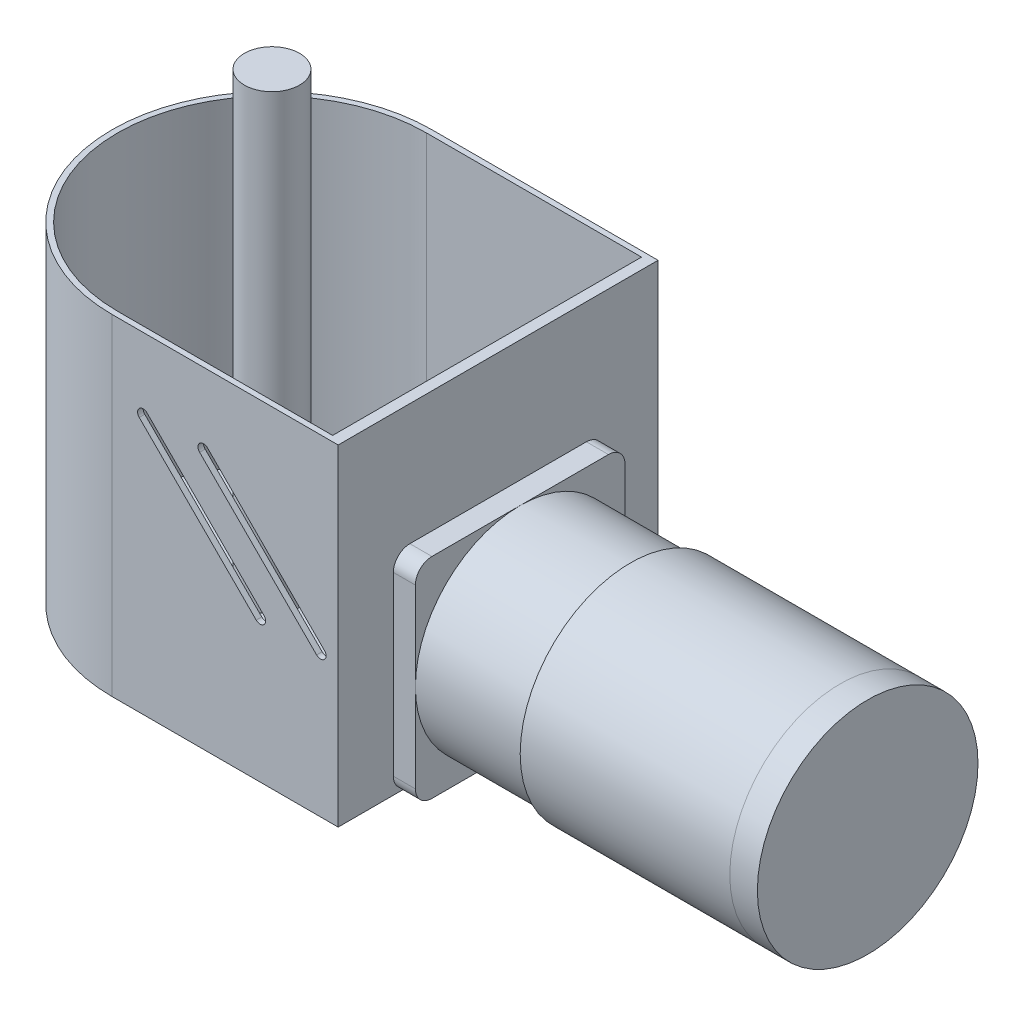
ISO-10303-21;
HEADER;
FILE_DESCRIPTION(('STEP AP214'),'2;1');
FILE_NAME('part.step','',(''),(''),'','','');
FILE_SCHEMA(('AUTOMOTIVE_DESIGN { 1 0 10303 214 1 1 1 1 }'));
ENDSEC;
DATA;
#1=APPLICATION_CONTEXT('core data for automotive mechanical design processes');
#2=APPLICATION_PROTOCOL_DEFINITION('international standard','automotive_design',2000,#1);
#3=PRODUCT_CONTEXT('',#1,'mechanical');
#4=PRODUCT('Part','Part','',(#3));
#5=PRODUCT_RELATED_PRODUCT_CATEGORY('part','',(#4));
#6=PRODUCT_DEFINITION_FORMATION('','',#4);
#7=PRODUCT_DEFINITION_CONTEXT('part definition',#1,'design');
#8=PRODUCT_DEFINITION('design','',#6,#7);
#9=PRODUCT_DEFINITION_SHAPE('','',#8);
#10=(LENGTH_UNIT() NAMED_UNIT(*) SI_UNIT(.MILLI.,.METRE.));
#11=(NAMED_UNIT(*) PLANE_ANGLE_UNIT() SI_UNIT($,.RADIAN.));
#12=(NAMED_UNIT(*) SI_UNIT($,.STERADIAN.) SOLID_ANGLE_UNIT());
#13=UNCERTAINTY_MEASURE_WITH_UNIT(LENGTH_MEASURE(1.E-05),#10,'distance_accuracy_value','');
#14=(GEOMETRIC_REPRESENTATION_CONTEXT(3) GLOBAL_UNCERTAINTY_ASSIGNED_CONTEXT((#13)) GLOBAL_UNIT_ASSIGNED_CONTEXT((#10,
#11,#12)) REPRESENTATION_CONTEXT('',''));
#15=CARTESIAN_POINT('',(0.,0.,0.));
#16=DIRECTION('',(0.,0.,1.));
#17=DIRECTION('',(1.,0.,0.));
#18=AXIS2_PLACEMENT_3D('',#15,#16,#17);
#19=CARTESIAN_POINT('',(137.,19.,-29.));
#20=DIRECTION('',(-1.,0.,0.));
#21=DIRECTION('',(0.,0.,1.));
#22=AXIS2_PLACEMENT_3D('',#19,#20,#21);
#23=CYLINDRICAL_SURFACE('',#22,20.);
#24=CARTESIAN_POINT('',(137.,19.,-29.));
#25=DIRECTION('',(1.,0.,0.));
#26=DIRECTION('',(0.,0.,-1.));
#27=AXIS2_PLACEMENT_3D('',#24,#25,#26);
#28=CIRCLE('',#27,20.);
#29=CARTESIAN_POINT('',(137.,19.,-49.));
#30=VERTEX_POINT('',#29);
#31=EDGE_CURVE('E11',#30,#30,#28,.T.);
#32=ORIENTED_EDGE('',*,*,#31,.F.);
#33=EDGE_LOOP('',(#32));
#34=FACE_BOUND('',#33,.T.);
#35=CARTESIAN_POINT('',(132.,19.,-29.));
#36=DIRECTION('',(1.,0.,0.));
#37=DIRECTION('',(0.,0.,-1.));
#38=AXIS2_PLACEMENT_3D('',#35,#36,#37);
#39=CIRCLE('',#38,20.);
#40=CARTESIAN_POINT('',(132.,19.,-49.));
#41=VERTEX_POINT('',#40);
#42=EDGE_CURVE('E47',#41,#41,#39,.T.);
#43=ORIENTED_EDGE('',*,*,#42,.T.);
#44=EDGE_LOOP('',(#43));
#45=FACE_BOUND('',#44,.T.);
#46=ADVANCED_FACE('F44',(#34,#45),#23,.T.);
#47=CARTESIAN_POINT('',(137.,19.,-29.));
#48=DIRECTION('',(1.,0.,0.));
#49=DIRECTION('',(0.,0.,-1.));
#50=AXIS2_PLACEMENT_3D('',#47,#48,#49);
#51=PLANE('',#50);
#52=ORIENTED_EDGE('',*,*,#31,.T.);
#53=EDGE_LOOP('',(#52));
#54=FACE_BOUND('',#53,.T.);
#55=ADVANCED_FACE('F59',(#54),#51,.T.);
#56=CARTESIAN_POINT('',(132.,19.,-29.));
#57=DIRECTION('',(1.,0.,0.));
#58=DIRECTION('',(0.,0.,-1.));
#59=AXIS2_PLACEMENT_3D('',#56,#57,#58);
#60=PLANE('',#59);
#61=ORIENTED_EDGE('',*,*,#42,.F.);
#62=EDGE_LOOP('',(#61));
#63=FACE_BOUND('',#62,.T.);
#64=ADVANCED_FACE('F57',(#63),#60,.F.);
#65=CLOSED_SHELL('',(#46,#55,#64));
#66=MANIFOLD_SOLID_BREP('B2',#65);
#67=CARTESIAN_POINT('',(74.,0.,0.));
#68=DIRECTION('',(-1.,0.,0.));
#69=DIRECTION('',(0.,0.,1.));
#70=AXIS2_PLACEMENT_3D('',#67,#68,#69);
#71=PLANE('',#70);
#72=CARTESIAN_POINT('',(74.,19.,-29.));
#73=DIRECTION('',(1.,0.,0.));
#74=DIRECTION('',(0.,0.,-1.));
#75=AXIS2_PLACEMENT_3D('',#72,#73,#74);
#76=CIRCLE('',#75,19.);
#77=CARTESIAN_POINT('',(74.,19.,-48.));
#78=VERTEX_POINT('',#77);
#79=CARTESIAN_POINT('',(74.,38.,-29.));
#80=VERTEX_POINT('',#79);
#81=EDGE_CURVE('E319',#78,#80,#76,.T.);
#82=ORIENTED_EDGE('',*,*,#81,.F.);
#83=DIRECTION('',(0.,1.,0.));
#84=VECTOR('',#83,1.);
#85=CARTESIAN_POINT('',(74.,0.,-48.));
#86=LINE('',#85,#84);
#87=CARTESIAN_POINT('',(74.,35.,-48.));
#88=VERTEX_POINT('',#87);
#89=EDGE_CURVE('E338',#78,#88,#86,.T.);
#90=ORIENTED_EDGE('',*,*,#89,.T.);
#91=CARTESIAN_POINT('',(74.,35.,-45.));
#92=DIRECTION('',(-1.,0.,0.));
#93=DIRECTION('',(0.,0.,1.));
#94=AXIS2_PLACEMENT_3D('',#91,#92,#93);
#95=CIRCLE('',#94,3.);
#96=CARTESIAN_POINT('',(74.,38.,-45.));
#97=VERTEX_POINT('',#96);
#98=EDGE_CURVE('E438',#88,#97,#95,.F.);
#99=ORIENTED_EDGE('',*,*,#98,.T.);
#100=DIRECTION('',(0.,0.,1.));
#101=VECTOR('',#100,1.);
#102=CARTESIAN_POINT('',(74.,38.,-10.));
#103=LINE('',#102,#101);
#104=EDGE_CURVE('E342',#97,#80,#103,.T.);
#105=ORIENTED_EDGE('',*,*,#104,.T.);
#106=EDGE_LOOP('',(#82,#90,#99,#105));
#107=FACE_BOUND('',#106,.T.);
#108=ADVANCED_FACE('F91',(#107),#71,.F.);
#109=CARTESIAN_POINT('',(74.,19.,-10.));
#110=VERTEX_POINT('',#109);
#111=EDGE_CURVE('E328',#80,#110,#76,.T.);
#112=ORIENTED_EDGE('',*,*,#111,.F.);
#113=CARTESIAN_POINT('',(74.,38.,-13.));
#114=VERTEX_POINT('',#113);
#115=EDGE_CURVE('E341',#80,#114,#103,.T.);
#116=ORIENTED_EDGE('',*,*,#115,.T.);
#117=CARTESIAN_POINT('',(74.,35.,-13.));
#118=DIRECTION('',(-1.,0.,0.));
#119=DIRECTION('',(0.,0.,1.));
#120=AXIS2_PLACEMENT_3D('',#117,#118,#119);
#121=CIRCLE('',#120,3.);
#122=CARTESIAN_POINT('',(74.,35.,-10.));
#123=VERTEX_POINT('',#122);
#124=EDGE_CURVE('E436',#114,#123,#121,.F.);
#125=ORIENTED_EDGE('',*,*,#124,.T.);
#126=DIRECTION('',(0.,-1.,0.));
#127=VECTOR('',#126,1.);
#128=CARTESIAN_POINT('',(74.,0.,-10.));
#129=LINE('',#128,#127);
#130=EDGE_CURVE('E330',#123,#110,#129,.T.);
#131=ORIENTED_EDGE('',*,*,#130,.T.);
#132=EDGE_LOOP('',(#112,#116,#125,#131));
#133=FACE_BOUND('',#132,.T.);
#134=ADVANCED_FACE('F575',(#133),#71,.F.);
#135=CARTESIAN_POINT('',(74.,0.,-29.));
#136=VERTEX_POINT('',#135);
#137=EDGE_CURVE('E584',#110,#136,#76,.T.);
#138=ORIENTED_EDGE('',*,*,#137,.F.);
#139=CARTESIAN_POINT('',(74.,3.,-10.));
#140=VERTEX_POINT('',#139);
#141=EDGE_CURVE('E334',#110,#140,#129,.T.);
#142=ORIENTED_EDGE('',*,*,#141,.T.);
#143=CARTESIAN_POINT('',(74.,3.,-13.));
#144=DIRECTION('',(-1.,0.,0.));
#145=DIRECTION('',(0.,0.,1.));
#146=AXIS2_PLACEMENT_3D('',#143,#144,#145);
#147=CIRCLE('',#146,3.);
#148=CARTESIAN_POINT('',(74.,0.,-13.));
#149=VERTEX_POINT('',#148);
#150=EDGE_CURVE('E434',#140,#149,#147,.F.);
#151=ORIENTED_EDGE('',*,*,#150,.T.);
#152=DIRECTION('',(0.,0.,-1.));
#153=VECTOR('',#152,1.);
#154=CARTESIAN_POINT('',(74.,0.,-10.));
#155=LINE('',#154,#153);
#156=EDGE_CURVE('E335',#149,#136,#155,.T.);
#157=ORIENTED_EDGE('',*,*,#156,.T.);
#158=EDGE_LOOP('',(#138,#142,#151,#157));
#159=FACE_BOUND('',#158,.T.);
#160=ADVANCED_FACE('F593',(#159),#71,.F.);
#161=CARTESIAN_POINT('',(70.,60.,0.));
#162=DIRECTION('',(-1.,0.,0.));
#163=DIRECTION('',(0.,0.,1.));
#164=AXIS2_PLACEMENT_3D('',#161,#162,#163);
#165=PLANE('',#164);
#166=DIRECTION('',(0.,-1.,0.));
#167=VECTOR('',#166,1.);
#168=CARTESIAN_POINT('',(70.,0.,-10.));
#169=LINE('',#168,#167);
#170=CARTESIAN_POINT('',(70.,35.,-10.));
#171=VERTEX_POINT('',#170);
#172=CARTESIAN_POINT('',(70.,3.,-10.));
#173=VERTEX_POINT('',#172);
#174=EDGE_CURVE('E325',#171,#173,#169,.T.);
#175=ORIENTED_EDGE('',*,*,#174,.F.);
#176=CARTESIAN_POINT('',(70.,35.,-13.));
#177=DIRECTION('',(-1.,0.,0.));
#178=DIRECTION('',(0.,0.,1.));
#179=AXIS2_PLACEMENT_3D('',#176,#177,#178);
#180=CIRCLE('',#179,3.);
#181=CARTESIAN_POINT('',(70.,38.,-13.));
#182=VERTEX_POINT('',#181);
#183=EDGE_CURVE('E459',#171,#182,#180,.T.);
#184=ORIENTED_EDGE('',*,*,#183,.T.);
#185=DIRECTION('',(0.,0.,1.));
#186=VECTOR('',#185,1.);
#187=CARTESIAN_POINT('',(70.,38.,-10.));
#188=LINE('',#187,#186);
#189=CARTESIAN_POINT('',(70.,38.,-45.));
#190=VERTEX_POINT('',#189);
#191=EDGE_CURVE('E351',#190,#182,#188,.T.);
#192=ORIENTED_EDGE('',*,*,#191,.F.);
#193=CARTESIAN_POINT('',(70.,35.,-45.));
#194=DIRECTION('',(-1.,0.,0.));
#195=DIRECTION('',(0.,0.,1.));
#196=AXIS2_PLACEMENT_3D('',#193,#194,#195);
#197=CIRCLE('',#196,3.);
#198=CARTESIAN_POINT('',(70.,35.,-48.));
#199=VERTEX_POINT('',#198);
#200=EDGE_CURVE('E457',#190,#199,#197,.T.);
#201=ORIENTED_EDGE('',*,*,#200,.T.);
#202=DIRECTION('',(0.,1.,0.));
#203=VECTOR('',#202,1.);
#204=CARTESIAN_POINT('',(70.,0.,-48.));
#205=LINE('',#204,#203);
#206=CARTESIAN_POINT('',(70.,3.,-48.));
#207=VERTEX_POINT('',#206);
#208=EDGE_CURVE('E348',#207,#199,#205,.T.);
#209=ORIENTED_EDGE('',*,*,#208,.F.);
#210=CARTESIAN_POINT('',(70.,3.,-45.));
#211=DIRECTION('',(-1.,0.,0.));
#212=DIRECTION('',(0.,0.,1.));
#213=AXIS2_PLACEMENT_3D('',#210,#211,#212);
#214=CIRCLE('',#213,3.);
#215=CARTESIAN_POINT('',(70.,0.,-45.));
#216=VERTEX_POINT('',#215);
#217=EDGE_CURVE('E454',#207,#216,#214,.T.);
#218=ORIENTED_EDGE('',*,*,#217,.T.);
#219=DIRECTION('',(0.,0.,-1.));
#220=VECTOR('',#219,1.);
#221=CARTESIAN_POINT('',(70.,0.,0.));
#222=LINE('',#221,#220);
#223=CARTESIAN_POINT('',(70.,0.,-58.));
#224=VERTEX_POINT('',#223);
#225=EDGE_CURVE('E397',#216,#224,#222,.T.);
#226=ORIENTED_EDGE('',*,*,#225,.T.);
#227=DIRECTION('',(0.,-1.,0.));
#228=VECTOR('',#227,1.);
#229=CARTESIAN_POINT('',(70.,60.,-58.));
#230=LINE('',#229,#228);
#231=CARTESIAN_POINT('',(70.,60.,-58.));
#232=VERTEX_POINT('',#231);
#233=EDGE_CURVE('E394',#232,#224,#230,.T.);
#234=ORIENTED_EDGE('',*,*,#233,.F.);
#235=DIRECTION('',(0.,0.,-1.));
#236=VECTOR('',#235,1.);
#237=CARTESIAN_POINT('',(70.,60.,0.));
#238=LINE('',#237,#236);
#239=CARTESIAN_POINT('',(70.,60.,0.));
#240=VERTEX_POINT('',#239);
#241=EDGE_CURVE('E388',#240,#232,#238,.T.);
#242=ORIENTED_EDGE('',*,*,#241,.F.);
#243=DIRECTION('',(0.,-1.,0.));
#244=VECTOR('',#243,1.);
#245=CARTESIAN_POINT('',(70.,60.,0.));
#246=LINE('',#245,#244);
#247=CARTESIAN_POINT('',(70.,0.,0.));
#248=VERTEX_POINT('',#247);
#249=EDGE_CURVE('E404',#240,#248,#246,.T.);
#250=ORIENTED_EDGE('',*,*,#249,.T.);
#251=CARTESIAN_POINT('',(70.,0.,-13.));
#252=VERTEX_POINT('',#251);
#253=EDGE_CURVE('E398',#248,#252,#222,.T.);
#254=ORIENTED_EDGE('',*,*,#253,.T.);
#255=CARTESIAN_POINT('',(70.,3.,-13.));
#256=DIRECTION('',(-1.,0.,0.));
#257=DIRECTION('',(0.,0.,1.));
#258=AXIS2_PLACEMENT_3D('',#255,#256,#257);
#259=CIRCLE('',#258,3.);
#260=EDGE_CURVE('E461',#252,#173,#259,.T.);
#261=ORIENTED_EDGE('',*,*,#260,.T.);
#262=EDGE_LOOP('',(#175,#184,#192,#201,#209,#218,#226,#234,#242,#250,#254,#261));
#263=FACE_BOUND('',#262,.T.);
#264=ADVANCED_FACE('F555',(#263),#165,.F.);
#265=CARTESIAN_POINT('',(0.,60.,0.));
#266=DIRECTION('',(0.,0.,-1.));
#267=DIRECTION('',(-1.,0.,0.));
#268=AXIS2_PLACEMENT_3D('',#265,#266,#267);
#269=PLANE('',#268);
#270=DIRECTION('',(0.707106781186548,-0.707106781186547,0.));
#271=VECTOR('',#270,1.);
#272=CARTESIAN_POINT('',(44.8847934373105,46.2928932188134,0.));
#273=LINE('',#272,#271);
#274=CARTESIAN_POINT('',(44.8847934373105,46.2928932188135,0.));
#275=VERTEX_POINT('',#274);
#276=CARTESIAN_POINT('',(66.0979968729069,25.079689783217,0.));
#277=VERTEX_POINT('',#276);
#278=EDGE_CURVE('E292',#275,#277,#273,.T.);
#279=ORIENTED_EDGE('',*,*,#278,.F.);
#280=CARTESIAN_POINT('',(45.5919002184971,47.,0.));
#281=DIRECTION('',(0.,0.,1.));
#282=DIRECTION('',(1.,0.,0.));
#283=AXIS2_PLACEMENT_3D('',#280,#281,#282);
#284=CIRCLE('',#283,1.00000000000001);
#285=CARTESIAN_POINT('',(46.2990069996836,47.7071067811866,0.));
#286=VERTEX_POINT('',#285);
#287=EDGE_CURVE('E106',#286,#275,#284,.T.);
#288=ORIENTED_EDGE('',*,*,#287,.F.);
#289=DIRECTION('',(-0.707106781186548,0.707106781186547,0.));
#290=VECTOR('',#289,1.);
#291=CARTESIAN_POINT('',(46.2990069996836,47.7071067811866,0.));
#292=LINE('',#291,#290);
#293=CARTESIAN_POINT('',(67.5122104352801,26.4939033455901,0.));
#294=VERTEX_POINT('',#293);
#295=EDGE_CURVE('E279',#294,#286,#292,.T.);
#296=ORIENTED_EDGE('',*,*,#295,.F.);
#297=CARTESIAN_POINT('',(66.8051036540935,25.7867965644036,0.));
#298=DIRECTION('',(0.,0.,1.));
#299=DIRECTION('',(1.,0.,0.));
#300=AXIS2_PLACEMENT_3D('',#297,#298,#299);
#301=CIRCLE('',#300,1.00000000000002);
#302=EDGE_CURVE('E285',#277,#294,#301,.T.);
#303=ORIENTED_EDGE('',*,*,#302,.F.);
#304=EDGE_LOOP('',(#279,#288,#296,#303));
#305=FACE_BOUND('',#304,.T.);
#306=DIRECTION('',(0.707106781186548,-0.707106781186547,0.));
#307=VECTOR('',#306,1.);
#308=CARTESIAN_POINT('',(33.9326874708981,46.2928932188134,0.));
#309=LINE('',#308,#307);
#310=CARTESIAN_POINT('',(33.9326874708981,46.2928932188134,0.));
#311=VERTEX_POINT('',#310);
#312=CARTESIAN_POINT('',(55.1458909064946,25.079689783217,0.));
#313=VERTEX_POINT('',#312);
#314=EDGE_CURVE('E294',#311,#313,#309,.T.);
#315=ORIENTED_EDGE('',*,*,#314,.F.);
#316=CARTESIAN_POINT('',(34.6397942520847,47.,0.));
#317=DIRECTION('',(0.,0.,1.));
#318=DIRECTION('',(1.,0.,0.));
#319=AXIS2_PLACEMENT_3D('',#316,#317,#318);
#320=CIRCLE('',#319,1.00000000000002);
#321=CARTESIAN_POINT('',(35.3469010332713,47.7071067811866,0.));
#322=VERTEX_POINT('',#321);
#323=EDGE_CURVE('E114',#322,#311,#320,.T.);
#324=ORIENTED_EDGE('',*,*,#323,.F.);
#325=DIRECTION('',(-0.707106781186547,0.707106781186547,0.));
#326=VECTOR('',#325,1.);
#327=CARTESIAN_POINT('',(35.3469010332713,47.7071067811866,0.));
#328=LINE('',#327,#326);
#329=CARTESIAN_POINT('',(56.5601044688677,26.4939033455901,0.));
#330=VERTEX_POINT('',#329);
#331=EDGE_CURVE('E304',#330,#322,#328,.T.);
#332=ORIENTED_EDGE('',*,*,#331,.F.);
#333=CARTESIAN_POINT('',(55.8529976876811,25.7867965644036,0.));
#334=DIRECTION('',(0.,0.,1.));
#335=DIRECTION('',(1.,0.,0.));
#336=AXIS2_PLACEMENT_3D('',#333,#334,#335);
#337=CIRCLE('',#336,1.00000000000001);
#338=EDGE_CURVE('E301',#313,#330,#337,.T.);
#339=ORIENTED_EDGE('',*,*,#338,.F.);
#340=EDGE_LOOP('',(#315,#324,#332,#339));
#341=FACE_BOUND('',#340,.T.);
#342=DIRECTION('',(1.,0.,0.));
#343=VECTOR('',#342,1.);
#344=CARTESIAN_POINT('',(0.,60.,0.));
#345=LINE('',#344,#343);
#346=CARTESIAN_POINT('',(29.,60.,0.));
#347=VERTEX_POINT('',#346);
#348=EDGE_CURVE('E386',#347,#240,#345,.T.);
#349=ORIENTED_EDGE('',*,*,#348,.F.);
#350=DIRECTION('',(0.,-1.,0.));
#351=VECTOR('',#350,1.);
#352=CARTESIAN_POINT('',(29.,60.,0.));
#353=LINE('',#352,#351);
#354=CARTESIAN_POINT('',(29.,0.,0.));
#355=VERTEX_POINT('',#354);
#356=EDGE_CURVE('E407',#347,#355,#353,.T.);
#357=ORIENTED_EDGE('',*,*,#356,.T.);
#358=DIRECTION('',(1.,0.,0.));
#359=VECTOR('',#358,1.);
#360=CARTESIAN_POINT('',(0.,0.,0.));
#361=LINE('',#360,#359);
#362=EDGE_CURVE('E395',#355,#248,#361,.T.);
#363=ORIENTED_EDGE('',*,*,#362,.T.);
#364=ORIENTED_EDGE('',*,*,#249,.F.);
#365=EDGE_LOOP('',(#349,#357,#363,#364));
#366=FACE_BOUND('',#365,.T.);
#367=ADVANCED_FACE('F289',(#305,#341,#366),#269,.F.);
#368=CARTESIAN_POINT('',(0.,60.,-58.));
#369=DIRECTION('',(0.,0.,1.));
#370=DIRECTION('',(1.,0.,0.));
#371=AXIS2_PLACEMENT_3D('',#368,#369,#370);
#372=PLANE('',#371);
#373=DIRECTION('',(-1.,0.,0.));
#374=VECTOR('',#373,1.);
#375=CARTESIAN_POINT('',(0.,0.,-58.));
#376=LINE('',#375,#374);
#377=CARTESIAN_POINT('',(29.,0.,-58.));
#378=VERTEX_POINT('',#377);
#379=EDGE_CURVE('E389',#224,#378,#376,.T.);
#380=ORIENTED_EDGE('',*,*,#379,.T.);
#381=DIRECTION('',(0.,-1.,0.));
#382=VECTOR('',#381,1.);
#383=CARTESIAN_POINT('',(29.,60.,-58.));
#384=LINE('',#383,#382);
#385=CARTESIAN_POINT('',(29.,60.,-58.));
#386=VERTEX_POINT('',#385);
#387=EDGE_CURVE('E418',#378,#386,#384,.F.);
#388=ORIENTED_EDGE('',*,*,#387,.T.);
#389=DIRECTION('',(-1.,0.,0.));
#390=VECTOR('',#389,1.);
#391=CARTESIAN_POINT('',(0.,60.,-58.));
#392=LINE('',#391,#390);
#393=EDGE_CURVE('E391',#232,#386,#392,.T.);
#394=ORIENTED_EDGE('',*,*,#393,.F.);
#395=ORIENTED_EDGE('',*,*,#233,.T.);
#396=EDGE_LOOP('',(#380,#388,#394,#395));
#397=FACE_BOUND('',#396,.T.);
#398=ADVANCED_FACE('F531',(#397),#372,.F.);
#399=CARTESIAN_POINT('',(0.,60.,0.));
#400=DIRECTION('',(0.,-1.,0.));
#401=DIRECTION('',(0.,0.,-1.));
#402=AXIS2_PLACEMENT_3D('',#399,#400,#401);
#403=PLANE('',#402);
#404=DIRECTION('',(1.,0.,0.));
#405=VECTOR('',#404,1.);
#406=CARTESIAN_POINT('',(68.,60.,-1.00000000000001));
#407=LINE('',#406,#405);
#408=CARTESIAN_POINT('',(29.,60.,-1.));
#409=VERTEX_POINT('',#408);
#410=CARTESIAN_POINT('',(68.,60.,-1.00000000000001));
#411=VERTEX_POINT('',#410);
#412=EDGE_CURVE('E369',#409,#411,#407,.T.);
#413=ORIENTED_EDGE('',*,*,#412,.F.);
#414=CARTESIAN_POINT('',(29.,60.,-29.));
#415=DIRECTION('',(0.,1.,0.));
#416=DIRECTION('',(0.,0.,1.));
#417=AXIS2_PLACEMENT_3D('',#414,#415,#416);
#418=CIRCLE('',#417,28.);
#419=CARTESIAN_POINT('',(29.,60.,-57.));
#420=VERTEX_POINT('',#419);
#421=EDGE_CURVE('E345',#420,#409,#418,.T.);
#422=ORIENTED_EDGE('',*,*,#421,.F.);
#423=DIRECTION('',(-1.,0.,0.));
#424=VECTOR('',#423,1.);
#425=CARTESIAN_POINT('',(29.,60.,-57.));
#426=LINE('',#425,#424);
#427=CARTESIAN_POINT('',(68.,60.,-57.));
#428=VERTEX_POINT('',#427);
#429=EDGE_CURVE('E358',#428,#420,#426,.T.);
#430=ORIENTED_EDGE('',*,*,#429,.F.);
#431=DIRECTION('',(0.,0.,-1.));
#432=VECTOR('',#431,1.);
#433=CARTESIAN_POINT('',(68.,60.,-57.));
#434=LINE('',#433,#432);
#435=EDGE_CURVE('E372',#411,#428,#434,.T.);
#436=ORIENTED_EDGE('',*,*,#435,.F.);
#437=EDGE_LOOP('',(#413,#422,#430,#436));
#438=FACE_BOUND('',#437,.T.);
#439=CARTESIAN_POINT('',(29.,60.,-29.));
#440=DIRECTION('',(0.,-1.,0.));
#441=DIRECTION('',(0.,0.,-1.));
#442=AXIS2_PLACEMENT_3D('',#439,#440,#441);
#443=CIRCLE('',#442,29.);
#444=CARTESIAN_POINT('',(0.,60.,-29.));
#445=VERTEX_POINT('',#444);
#446=EDGE_CURVE('E414',#386,#445,#443,.F.);
#447=ORIENTED_EDGE('',*,*,#446,.T.);
#448=CARTESIAN_POINT('',(29.,60.,-29.));
#449=DIRECTION('',(0.,-1.,0.));
#450=DIRECTION('',(0.,0.,-1.));
#451=AXIS2_PLACEMENT_3D('',#448,#449,#450);
#452=CIRCLE('',#451,29.);
#453=EDGE_CURVE('E416',#445,#347,#452,.F.);
#454=ORIENTED_EDGE('',*,*,#453,.T.);
#455=ORIENTED_EDGE('',*,*,#348,.T.);
#456=ORIENTED_EDGE('',*,*,#241,.T.);
#457=ORIENTED_EDGE('',*,*,#393,.T.);
#458=EDGE_LOOP('',(#447,#454,#455,#456,#457));
#459=FACE_BOUND('',#458,.T.);
#460=ADVANCED_FACE('F527',(#438,#459),#403,.F.);
#461=CARTESIAN_POINT('',(0.,0.,0.));
#462=DIRECTION('',(0.,-1.,0.));
#463=DIRECTION('',(0.,0.,-1.));
#464=AXIS2_PLACEMENT_3D('',#461,#462,#463);
#465=PLANE('',#464);
#466=ORIENTED_EDGE('',*,*,#225,.F.);
#467=DIRECTION('',(-1.,0.,0.));
#468=VECTOR('',#467,1.);
#469=CARTESIAN_POINT('',(74.,0.,-45.));
#470=LINE('',#469,#468);
#471=CARTESIAN_POINT('',(74.,0.,-45.));
#472=VERTEX_POINT('',#471);
#473=EDGE_CURVE('E431',#216,#472,#470,.F.);
#474=ORIENTED_EDGE('',*,*,#473,.T.);
#475=EDGE_CURVE('E333',#136,#472,#155,.T.);
#476=ORIENTED_EDGE('',*,*,#475,.F.);
#477=ORIENTED_EDGE('',*,*,#156,.F.);
#478=DIRECTION('',(-1.,0.,0.));
#479=VECTOR('',#478,1.);
#480=CARTESIAN_POINT('',(70.,0.,-13.));
#481=LINE('',#480,#479);
#482=EDGE_CURVE('E428',#149,#252,#481,.T.);
#483=ORIENTED_EDGE('',*,*,#482,.T.);
#484=ORIENTED_EDGE('',*,*,#253,.F.);
#485=ORIENTED_EDGE('',*,*,#362,.F.);
#486=CARTESIAN_POINT('',(29.,0.,-29.));
#487=DIRECTION('',(0.,-1.,0.));
#488=DIRECTION('',(0.,0.,-1.));
#489=AXIS2_PLACEMENT_3D('',#486,#487,#488);
#490=CIRCLE('',#489,29.);
#491=CARTESIAN_POINT('',(0.,0.,-29.));
#492=VERTEX_POINT('',#491);
#493=EDGE_CURVE('E412',#355,#492,#490,.T.);
#494=ORIENTED_EDGE('',*,*,#493,.T.);
#495=CARTESIAN_POINT('',(29.,0.,-29.));
#496=DIRECTION('',(0.,-1.,0.));
#497=DIRECTION('',(0.,0.,-1.));
#498=AXIS2_PLACEMENT_3D('',#495,#496,#497);
#499=CIRCLE('',#498,29.);
#500=EDGE_CURVE('E410',#492,#378,#499,.T.);
#501=ORIENTED_EDGE('',*,*,#500,.T.);
#502=ORIENTED_EDGE('',*,*,#379,.F.);
#503=EDGE_LOOP('',(#466,#474,#476,#477,#483,#484,#485,#494,#501,#502));
#504=FACE_BOUND('',#503,.T.);
#505=ADVANCED_FACE('F530',(#504),#465,.T.);
#506=CARTESIAN_POINT('',(29.,60.,-29.));
#507=DIRECTION('',(0.,-1.,0.));
#508=DIRECTION('',(0.,0.,-1.));
#509=AXIS2_PLACEMENT_3D('',#506,#507,#508);
#510=CYLINDRICAL_SURFACE('',#509,29.);
#511=DIRECTION('',(0.,-1.,0.));
#512=VECTOR('',#511,1.);
#513=CARTESIAN_POINT('',(0.,60.,-29.));
#514=LINE('',#513,#512);
#515=EDGE_CURVE('E379',#445,#492,#514,.T.);
#516=ORIENTED_EDGE('',*,*,#515,.F.);
#517=ORIENTED_EDGE('',*,*,#446,.F.);
#518=ORIENTED_EDGE('',*,*,#387,.F.);
#519=ORIENTED_EDGE('',*,*,#500,.F.);
#520=EDGE_LOOP('',(#516,#517,#518,#519));
#521=FACE_BOUND('',#520,.T.);
#522=ADVANCED_FACE('F541',(#521),#510,.T.);
#523=CARTESIAN_POINT('',(29.,60.,-29.));
#524=DIRECTION('',(0.,-1.,0.));
#525=DIRECTION('',(0.,0.,-1.));
#526=AXIS2_PLACEMENT_3D('',#523,#524,#525);
#527=CYLINDRICAL_SURFACE('',#526,29.);
#528=ORIENTED_EDGE('',*,*,#453,.F.);
#529=ORIENTED_EDGE('',*,*,#515,.T.);
#530=ORIENTED_EDGE('',*,*,#493,.F.);
#531=ORIENTED_EDGE('',*,*,#356,.F.);
#532=EDGE_LOOP('',(#528,#529,#530,#531));
#533=FACE_BOUND('',#532,.T.);
#534=ADVANCED_FACE('F544',(#533),#527,.T.);
#535=CARTESIAN_POINT('',(29.,1.99999999999999,-29.));
#536=DIRECTION('',(0.,1.,0.));
#537=DIRECTION('',(0.,0.,1.));
#538=AXIS2_PLACEMENT_3D('',#535,#536,#537);
#539=CYLINDRICAL_SURFACE('',#538,28.);
#540=ORIENTED_EDGE('',*,*,#421,.T.);
#541=DIRECTION('',(0.,1.,0.));
#542=VECTOR('',#541,1.);
#543=CARTESIAN_POINT('',(29.,1.99999999999999,-1.));
#544=LINE('',#543,#542);
#545=CARTESIAN_POINT('',(29.,1.99999999999999,-1.));
#546=VERTEX_POINT('',#545);
#547=EDGE_CURVE('E367',#546,#409,#544,.T.);
#548=ORIENTED_EDGE('',*,*,#547,.F.);
#549=CARTESIAN_POINT('',(29.,1.99999999999999,-29.));
#550=DIRECTION('',(0.,1.,0.));
#551=DIRECTION('',(0.,0.,1.));
#552=AXIS2_PLACEMENT_3D('',#549,#550,#551);
#553=CIRCLE('',#552,28.);
#554=CARTESIAN_POINT('',(29.,1.99999999999999,-57.));
#555=VERTEX_POINT('',#554);
#556=EDGE_CURVE('E354',#555,#546,#553,.T.);
#557=ORIENTED_EDGE('',*,*,#556,.F.);
#558=DIRECTION('',(0.,1.,0.));
#559=VECTOR('',#558,1.);
#560=CARTESIAN_POINT('',(29.,1.99999999999999,-57.));
#561=LINE('',#560,#559);
#562=EDGE_CURVE('E377',#555,#420,#561,.T.);
#563=ORIENTED_EDGE('',*,*,#562,.T.);
#564=EDGE_LOOP('',(#540,#548,#557,#563));
#565=FACE_BOUND('',#564,.T.);
#566=ADVANCED_FACE('F515',(#565),#539,.F.);
#567=CARTESIAN_POINT('',(29.,1.99999999999999,-57.));
#568=DIRECTION('',(0.,0.,-1.));
#569=DIRECTION('',(-1.,0.,0.));
#570=AXIS2_PLACEMENT_3D('',#567,#568,#569);
#571=PLANE('',#570);
#572=ORIENTED_EDGE('',*,*,#429,.T.);
#573=ORIENTED_EDGE('',*,*,#562,.F.);
#574=DIRECTION('',(-1.,0.,0.));
#575=VECTOR('',#574,1.);
#576=CARTESIAN_POINT('',(29.,1.99999999999999,-57.));
#577=LINE('',#576,#575);
#578=CARTESIAN_POINT('',(68.,1.99999999999999,-57.));
#579=VERTEX_POINT('',#578);
#580=EDGE_CURVE('E364',#579,#555,#577,.T.);
#581=ORIENTED_EDGE('',*,*,#580,.F.);
#582=DIRECTION('',(0.,1.,0.));
#583=VECTOR('',#582,1.);
#584=CARTESIAN_POINT('',(68.,1.99999999999999,-57.));
#585=LINE('',#584,#583);
#586=EDGE_CURVE('E380',#579,#428,#585,.T.);
#587=ORIENTED_EDGE('',*,*,#586,.T.);
#588=EDGE_LOOP('',(#572,#573,#581,#587));
#589=FACE_BOUND('',#588,.T.);
#590=ADVANCED_FACE('F524',(#589),#571,.F.);
#591=CARTESIAN_POINT('',(68.,1.99999999999999,-57.));
#592=DIRECTION('',(1.,0.,0.));
#593=DIRECTION('',(0.,0.,-1.));
#594=AXIS2_PLACEMENT_3D('',#591,#592,#593);
#595=PLANE('',#594);
#596=ORIENTED_EDGE('',*,*,#435,.T.);
#597=ORIENTED_EDGE('',*,*,#586,.F.);
#598=DIRECTION('',(0.,0.,-1.));
#599=VECTOR('',#598,1.);
#600=CARTESIAN_POINT('',(68.,1.99999999999999,-57.));
#601=LINE('',#600,#599);
#602=CARTESIAN_POINT('',(68.,1.99999999999999,-1.00000000000001));
#603=VERTEX_POINT('',#602);
#604=EDGE_CURVE('E361',#603,#579,#601,.T.);
#605=ORIENTED_EDGE('',*,*,#604,.F.);
#606=DIRECTION('',(0.,1.,0.));
#607=VECTOR('',#606,1.);
#608=CARTESIAN_POINT('',(68.,1.99999999999999,-1.00000000000001));
#609=LINE('',#608,#607);
#610=EDGE_CURVE('E382',#603,#411,#609,.T.);
#611=ORIENTED_EDGE('',*,*,#610,.T.);
#612=EDGE_LOOP('',(#596,#597,#605,#611));
#613=FACE_BOUND('',#612,.T.);
#614=ADVANCED_FACE('F522',(#613),#595,.F.);
#615=CARTESIAN_POINT('',(68.,1.99999999999999,-1.00000000000001));
#616=DIRECTION('',(0.,0.,1.));
#617=DIRECTION('',(1.,0.,0.));
#618=AXIS2_PLACEMENT_3D('',#615,#616,#617);
#619=PLANE('',#618);
#620=DIRECTION('',(-0.707106781186548,0.707106781186547,0.));
#621=VECTOR('',#620,1.);
#622=CARTESIAN_POINT('',(80.0030568904351,14.0030568904351,-1.00000000000001));
#623=LINE('',#622,#621);
#624=CARTESIAN_POINT('',(67.5122104352801,26.4939033455901,-1.00000000000001));
#625=VERTEX_POINT('',#624);
#626=CARTESIAN_POINT('',(46.2990069996836,47.7071067811866,-1.));
#627=VERTEX_POINT('',#626);
#628=EDGE_CURVE('E99',#625,#627,#623,.T.);
#629=ORIENTED_EDGE('',*,*,#628,.T.);
#630=CARTESIAN_POINT('',(45.5919002184971,47.,-1.));
#631=DIRECTION('',(0.,0.,1.));
#632=DIRECTION('',(1.,0.,0.));
#633=AXIS2_PLACEMENT_3D('',#630,#631,#632);
#634=CIRCLE('',#633,1.00000000000001);
#635=CARTESIAN_POINT('',(44.8847934373105,46.2928932188134,-1.));
#636=VERTEX_POINT('',#635);
#637=EDGE_CURVE('E42',#627,#636,#634,.T.);
#638=ORIENTED_EDGE('',*,*,#637,.T.);
#639=DIRECTION('',(0.707106781186548,-0.707106781186547,0.));
#640=VECTOR('',#639,1.);
#641=CARTESIAN_POINT('',(78.588843328062,12.588843328062,-1.00000000000001));
#642=LINE('',#641,#640);
#643=CARTESIAN_POINT('',(66.0979968729069,25.079689783217,-1.00000000000001));
#644=VERTEX_POINT('',#643);
#645=EDGE_CURVE('E475',#636,#644,#642,.T.);
#646=ORIENTED_EDGE('',*,*,#645,.T.);
#647=CARTESIAN_POINT('',(66.8051036540935,25.7867965644036,-1.00000000000001));
#648=DIRECTION('',(0.,0.,1.));
#649=DIRECTION('',(1.,0.,0.));
#650=AXIS2_PLACEMENT_3D('',#647,#648,#649);
#651=CIRCLE('',#650,1.00000000000002);
#652=EDGE_CURVE('E478',#644,#625,#651,.T.);
#653=ORIENTED_EDGE('',*,*,#652,.T.);
#654=EDGE_LOOP('',(#629,#638,#646,#653));
#655=FACE_BOUND('',#654,.T.);
#656=DIRECTION('',(-0.707106781186548,0.707106781186548,0.));
#657=VECTOR('',#656,1.);
#658=CARTESIAN_POINT('',(74.5270039072289,8.5270039072289,-1.00000000000001));
#659=LINE('',#658,#657);
#660=CARTESIAN_POINT('',(56.5601044688677,26.4939033455901,-1.));
#661=VERTEX_POINT('',#660);
#662=CARTESIAN_POINT('',(35.3469010332713,47.7071067811866,-1.));
#663=VERTEX_POINT('',#662);
#664=EDGE_CURVE('E469',#661,#663,#659,.T.);
#665=ORIENTED_EDGE('',*,*,#664,.T.);
#666=CARTESIAN_POINT('',(34.6397942520847,47.,-1.));
#667=DIRECTION('',(0.,0.,1.));
#668=DIRECTION('',(1.,0.,0.));
#669=AXIS2_PLACEMENT_3D('',#666,#667,#668);
#670=CIRCLE('',#669,1.00000000000002);
#671=CARTESIAN_POINT('',(33.9326874708981,46.2928932188134,-1.));
#672=VERTEX_POINT('',#671);
#673=EDGE_CURVE('E472',#663,#672,#670,.T.);
#674=ORIENTED_EDGE('',*,*,#673,.T.);
#675=DIRECTION('',(0.707106781186548,-0.707106781186547,0.));
#676=VECTOR('',#675,1.);
#677=CARTESIAN_POINT('',(73.1127903448558,7.11279034485583,-1.00000000000001));
#678=LINE('',#677,#676);
#679=CARTESIAN_POINT('',(55.1458909064946,25.079689783217,-1.));
#680=VERTEX_POINT('',#679);
#681=EDGE_CURVE('E463',#672,#680,#678,.T.);
#682=ORIENTED_EDGE('',*,*,#681,.T.);
#683=CARTESIAN_POINT('',(55.8529976876811,25.7867965644036,-1.));
#684=DIRECTION('',(0.,0.,1.));
#685=DIRECTION('',(1.,0.,0.));
#686=AXIS2_PLACEMENT_3D('',#683,#684,#685);
#687=CIRCLE('',#686,1.00000000000001);
#688=EDGE_CURVE('E466',#680,#661,#687,.T.);
#689=ORIENTED_EDGE('',*,*,#688,.T.);
#690=EDGE_LOOP('',(#665,#674,#682,#689));
#691=FACE_BOUND('',#690,.T.);
#692=ORIENTED_EDGE('',*,*,#412,.T.);
#693=ORIENTED_EDGE('',*,*,#610,.F.);
#694=DIRECTION('',(1.,0.,0.));
#695=VECTOR('',#694,1.);
#696=CARTESIAN_POINT('',(68.,1.99999999999999,-1.00000000000001));
#697=LINE('',#696,#695);
#698=EDGE_CURVE('E357',#546,#603,#697,.T.);
#699=ORIENTED_EDGE('',*,*,#698,.F.);
#700=ORIENTED_EDGE('',*,*,#547,.T.);
#701=EDGE_LOOP('',(#692,#693,#699,#700));
#702=FACE_BOUND('',#701,.T.);
#703=ADVANCED_FACE('F481',(#655,#691,#702),#619,.F.);
#704=CARTESIAN_POINT('',(29.,1.99999999999999,-29.));
#705=DIRECTION('',(0.,1.,0.));
#706=DIRECTION('',(0.,0.,1.));
#707=AXIS2_PLACEMENT_3D('',#704,#705,#706);
#708=PLANE('',#707);
#709=CARTESIAN_POINT('',(29.,1.99999999999999,-29.));
#710=DIRECTION('',(0.,1.,0.));
#711=DIRECTION('',(0.,0.,1.));
#712=AXIS2_PLACEMENT_3D('',#709,#710,#711);
#713=CIRCLE('',#712,5.);
#714=CARTESIAN_POINT('',(29.,1.99999999999999,-24.));
#715=VERTEX_POINT('',#714);
#716=EDGE_CURVE('E491',#715,#715,#713,.T.);
#717=ORIENTED_EDGE('',*,*,#716,.F.);
#718=EDGE_LOOP('',(#717));
#719=FACE_BOUND('',#718,.T.);
#720=ORIENTED_EDGE('',*,*,#556,.T.);
#721=ORIENTED_EDGE('',*,*,#698,.T.);
#722=ORIENTED_EDGE('',*,*,#604,.T.);
#723=ORIENTED_EDGE('',*,*,#580,.T.);
#724=EDGE_LOOP('',(#720,#721,#722,#723));
#725=FACE_BOUND('',#724,.T.);
#726=ADVANCED_FACE('F506',(#719,#725),#708,.T.);
#727=CARTESIAN_POINT('',(74.,0.,-10.));
#728=DIRECTION('',(0.,0.,-1.));
#729=DIRECTION('',(-1.,0.,0.));
#730=AXIS2_PLACEMENT_3D('',#727,#728,#729);
#731=PLANE('',#730);
#732=ORIENTED_EDGE('',*,*,#130,.F.);
#733=DIRECTION('',(-1.,0.,0.));
#734=VECTOR('',#733,1.);
#735=CARTESIAN_POINT('',(74.,35.,-10.));
#736=LINE('',#735,#734);
#737=EDGE_CURVE('E451',#123,#171,#736,.T.);
#738=ORIENTED_EDGE('',*,*,#737,.T.);
#739=ORIENTED_EDGE('',*,*,#174,.T.);
#740=DIRECTION('',(-1.,0.,0.));
#741=VECTOR('',#740,1.);
#742=CARTESIAN_POINT('',(74.,3.,-10.));
#743=LINE('',#742,#741);
#744=EDGE_CURVE('E448',#173,#140,#743,.F.);
#745=ORIENTED_EDGE('',*,*,#744,.T.);
#746=ORIENTED_EDGE('',*,*,#141,.F.);
#747=EDGE_LOOP('',(#732,#738,#739,#745,#746));
#748=FACE_BOUND('',#747,.T.);
#749=ADVANCED_FACE('F509',(#748),#731,.F.);
#750=CARTESIAN_POINT('',(74.,0.,-48.));
#751=DIRECTION('',(0.,0.,1.));
#752=DIRECTION('',(1.,0.,0.));
#753=AXIS2_PLACEMENT_3D('',#750,#751,#752);
#754=PLANE('',#753);
#755=CARTESIAN_POINT('',(74.,3.,-48.));
#756=VERTEX_POINT('',#755);
#757=EDGE_CURVE('E339',#756,#78,#86,.T.);
#758=ORIENTED_EDGE('',*,*,#757,.F.);
#759=DIRECTION('',(-1.,0.,0.));
#760=VECTOR('',#759,1.);
#761=CARTESIAN_POINT('',(70.,3.,-48.));
#762=LINE('',#761,#760);
#763=EDGE_CURVE('E425',#756,#207,#762,.T.);
#764=ORIENTED_EDGE('',*,*,#763,.T.);
#765=ORIENTED_EDGE('',*,*,#208,.T.);
#766=DIRECTION('',(-1.,0.,0.));
#767=VECTOR('',#766,1.);
#768=CARTESIAN_POINT('',(74.,35.,-48.));
#769=LINE('',#768,#767);
#770=EDGE_CURVE('E420',#199,#88,#769,.F.);
#771=ORIENTED_EDGE('',*,*,#770,.T.);
#772=ORIENTED_EDGE('',*,*,#89,.F.);
#773=EDGE_LOOP('',(#758,#764,#765,#771,#772));
#774=FACE_BOUND('',#773,.T.);
#775=ADVANCED_FACE('F640',(#774),#754,.F.);
#776=CARTESIAN_POINT('',(74.,38.,-10.));
#777=DIRECTION('',(0.,-1.,0.));
#778=DIRECTION('',(0.,0.,-1.));
#779=AXIS2_PLACEMENT_3D('',#776,#777,#778);
#780=PLANE('',#779);
#781=ORIENTED_EDGE('',*,*,#104,.F.);
#782=DIRECTION('',(-1.,0.,0.));
#783=VECTOR('',#782,1.);
#784=CARTESIAN_POINT('',(74.,38.,-45.));
#785=LINE('',#784,#783);
#786=EDGE_CURVE('E445',#97,#190,#785,.T.);
#787=ORIENTED_EDGE('',*,*,#786,.T.);
#788=ORIENTED_EDGE('',*,*,#191,.T.);
#789=DIRECTION('',(-1.,0.,0.));
#790=VECTOR('',#789,1.);
#791=CARTESIAN_POINT('',(74.,38.,-13.));
#792=LINE('',#791,#790);
#793=EDGE_CURVE('E442',#182,#114,#792,.F.);
#794=ORIENTED_EDGE('',*,*,#793,.T.);
#795=ORIENTED_EDGE('',*,*,#115,.F.);
#796=EDGE_LOOP('',(#781,#787,#788,#794,#795));
#797=FACE_BOUND('',#796,.T.);
#798=ADVANCED_FACE('F569',(#797),#780,.F.);
#799=EDGE_CURVE('E329',#136,#78,#76,.T.);
#800=ORIENTED_EDGE('',*,*,#799,.F.);
#801=ORIENTED_EDGE('',*,*,#475,.T.);
#802=CARTESIAN_POINT('',(74.,3.,-45.));
#803=DIRECTION('',(-1.,0.,0.));
#804=DIRECTION('',(0.,0.,1.));
#805=AXIS2_PLACEMENT_3D('',#802,#803,#804);
#806=CIRCLE('',#805,3.);
#807=EDGE_CURVE('E440',#472,#756,#806,.F.);
#808=ORIENTED_EDGE('',*,*,#807,.T.);
#809=ORIENTED_EDGE('',*,*,#757,.T.);
#810=EDGE_LOOP('',(#800,#801,#808,#809));
#811=FACE_BOUND('',#810,.T.);
#812=ADVANCED_FACE('F587',(#811),#71,.F.);
#813=CARTESIAN_POINT('',(74.,3.,-45.));
#814=DIRECTION('',(1.,0.,0.));
#815=DIRECTION('',(0.,0.,-1.));
#816=AXIS2_PLACEMENT_3D('',#813,#814,#815);
#817=CYLINDRICAL_SURFACE('',#816,3.);
#818=ORIENTED_EDGE('',*,*,#807,.F.);
#819=ORIENTED_EDGE('',*,*,#473,.F.);
#820=ORIENTED_EDGE('',*,*,#217,.F.);
#821=ORIENTED_EDGE('',*,*,#763,.F.);
#822=EDGE_LOOP('',(#818,#819,#820,#821));
#823=FACE_BOUND('',#822,.T.);
#824=ADVANCED_FACE('F604',(#823),#817,.T.);
#825=CARTESIAN_POINT('',(74.,35.,-45.));
#826=DIRECTION('',(-1.,0.,0.));
#827=DIRECTION('',(0.,0.,1.));
#828=AXIS2_PLACEMENT_3D('',#825,#826,#827);
#829=CYLINDRICAL_SURFACE('',#828,3.);
#830=ORIENTED_EDGE('',*,*,#98,.F.);
#831=ORIENTED_EDGE('',*,*,#770,.F.);
#832=ORIENTED_EDGE('',*,*,#200,.F.);
#833=ORIENTED_EDGE('',*,*,#786,.F.);
#834=EDGE_LOOP('',(#830,#831,#832,#833));
#835=FACE_BOUND('',#834,.T.);
#836=ADVANCED_FACE('F874',(#835),#829,.T.);
#837=CARTESIAN_POINT('',(74.,35.,-13.));
#838=DIRECTION('',(-1.,0.,0.));
#839=DIRECTION('',(0.,0.,1.));
#840=AXIS2_PLACEMENT_3D('',#837,#838,#839);
#841=CYLINDRICAL_SURFACE('',#840,3.);
#842=ORIENTED_EDGE('',*,*,#124,.F.);
#843=ORIENTED_EDGE('',*,*,#793,.F.);
#844=ORIENTED_EDGE('',*,*,#183,.F.);
#845=ORIENTED_EDGE('',*,*,#737,.F.);
#846=EDGE_LOOP('',(#842,#843,#844,#845));
#847=FACE_BOUND('',#846,.T.);
#848=ADVANCED_FACE('F573',(#847),#841,.T.);
#849=CARTESIAN_POINT('',(0.,3.,-13.));
#850=DIRECTION('',(1.,0.,0.));
#851=DIRECTION('',(0.,0.,-1.));
#852=AXIS2_PLACEMENT_3D('',#849,#850,#851);
#853=CYLINDRICAL_SURFACE('',#852,3.);
#854=ORIENTED_EDGE('',*,*,#150,.F.);
#855=ORIENTED_EDGE('',*,*,#744,.F.);
#856=ORIENTED_EDGE('',*,*,#260,.F.);
#857=ORIENTED_EDGE('',*,*,#482,.F.);
#858=EDGE_LOOP('',(#854,#855,#856,#857));
#859=FACE_BOUND('',#858,.T.);
#860=ADVANCED_FACE('F93',(#859),#853,.T.);
#861=CARTESIAN_POINT('',(94.,19.,-29.));
#862=DIRECTION('',(-1.,0.,0.));
#863=DIRECTION('',(0.,0.,1.));
#864=AXIS2_PLACEMENT_3D('',#861,#862,#863);
#865=CYLINDRICAL_SURFACE('',#864,19.);
#866=CARTESIAN_POINT('',(94.,19.,-29.));
#867=DIRECTION('',(1.,0.,0.));
#868=DIRECTION('',(0.,0.,-1.));
#869=AXIS2_PLACEMENT_3D('',#866,#867,#868);
#870=CIRCLE('',#869,19.);
#871=CARTESIAN_POINT('',(94.,19.,-48.));
#872=VERTEX_POINT('',#871);
#873=EDGE_CURVE('E322',#872,#872,#870,.T.);
#874=ORIENTED_EDGE('',*,*,#873,.F.);
#875=EDGE_LOOP('',(#874));
#876=FACE_BOUND('',#875,.T.);
#877=ORIENTED_EDGE('',*,*,#81,.T.);
#878=ORIENTED_EDGE('',*,*,#111,.T.);
#879=ORIENTED_EDGE('',*,*,#137,.T.);
#880=ORIENTED_EDGE('',*,*,#799,.T.);
#881=EDGE_LOOP('',(#877,#878,#879,#880));
#882=FACE_BOUND('',#881,.T.);
#883=ADVANCED_FACE('F582',(#876,#882),#865,.T.);
#884=CARTESIAN_POINT('',(132.,19.,-29.));
#885=DIRECTION('',(-1.,0.,0.));
#886=DIRECTION('',(0.,0.,1.));
#887=AXIS2_PLACEMENT_3D('',#884,#885,#886);
#888=CYLINDRICAL_SURFACE('',#887,20.);
#889=CARTESIAN_POINT('',(132.,19.,-29.));
#890=DIRECTION('',(1.,0.,0.));
#891=DIRECTION('',(0.,0.,-1.));
#892=AXIS2_PLACEMENT_3D('',#889,#890,#891);
#893=CIRCLE('',#892,20.);
#894=CARTESIAN_POINT('',(132.,19.,-49.));
#895=VERTEX_POINT('',#894);
#896=EDGE_CURVE('E316',#895,#895,#893,.T.);
#897=ORIENTED_EDGE('',*,*,#896,.F.);
#898=EDGE_LOOP('',(#897));
#899=FACE_BOUND('',#898,.T.);
#900=CARTESIAN_POINT('',(94.,19.,-29.));
#901=DIRECTION('',(1.,0.,0.));
#902=DIRECTION('',(0.,0.,-1.));
#903=AXIS2_PLACEMENT_3D('',#900,#901,#902);
#904=CIRCLE('',#903,20.);
#905=CARTESIAN_POINT('',(94.,19.,-49.));
#906=VERTEX_POINT('',#905);
#907=EDGE_CURVE('E310',#906,#906,#904,.T.);
#908=ORIENTED_EDGE('',*,*,#907,.T.);
#909=EDGE_LOOP('',(#908));
#910=FACE_BOUND('',#909,.T.);
#911=ADVANCED_FACE('F677',(#899,#910),#888,.T.);
#912=CARTESIAN_POINT('',(132.,19.,-29.));
#913=DIRECTION('',(1.,0.,0.));
#914=DIRECTION('',(0.,0.,-1.));
#915=AXIS2_PLACEMENT_3D('',#912,#913,#914);
#916=PLANE('',#915);
#917=ORIENTED_EDGE('',*,*,#896,.T.);
#918=EDGE_LOOP('',(#917));
#919=FACE_BOUND('',#918,.T.);
#920=ADVANCED_FACE('F688',(#919),#916,.T.);
#921=CARTESIAN_POINT('',(94.,19.,-29.));
#922=DIRECTION('',(1.,0.,0.));
#923=DIRECTION('',(0.,0.,-1.));
#924=AXIS2_PLACEMENT_3D('',#921,#922,#923);
#925=PLANE('',#924);
#926=ORIENTED_EDGE('',*,*,#873,.T.);
#927=EDGE_LOOP('',(#926));
#928=FACE_BOUND('',#927,.T.);
#929=ORIENTED_EDGE('',*,*,#907,.F.);
#930=EDGE_LOOP('',(#929));
#931=FACE_BOUND('',#930,.T.);
#932=ADVANCED_FACE('F699',(#928,#931),#925,.F.);
#933=CARTESIAN_POINT('',(34.6397942520847,47.,-5.));
#934=DIRECTION('',(0.,0.,1.));
#935=DIRECTION('',(1.,0.,0.));
#936=AXIS2_PLACEMENT_3D('',#933,#934,#935);
#937=CYLINDRICAL_SURFACE('',#936,1.00000000000002);
#938=DIRECTION('',(0.,0.,1.));
#939=VECTOR('',#938,1.);
#940=CARTESIAN_POINT('',(35.3469010332713,47.7071067811866,-5.));
#941=LINE('',#940,#939);
#942=EDGE_CURVE('E308',#663,#322,#941,.T.);
#943=ORIENTED_EDGE('',*,*,#942,.T.);
#944=ORIENTED_EDGE('',*,*,#323,.T.);
#945=DIRECTION('',(0.,0.,1.));
#946=VECTOR('',#945,1.);
#947=CARTESIAN_POINT('',(33.9326874708981,46.2928932188134,-5.));
#948=LINE('',#947,#946);
#949=EDGE_CURVE('E307',#672,#311,#948,.T.);
#950=ORIENTED_EDGE('',*,*,#949,.F.);
#951=ORIENTED_EDGE('',*,*,#673,.F.);
#952=EDGE_LOOP('',(#943,#944,#950,#951));
#953=FACE_BOUND('',#952,.T.);
#954=ADVANCED_FACE('F710',(#953),#937,.F.);
#955=CARTESIAN_POINT('',(35.3469010332713,47.7071067811866,-5.));
#956=DIRECTION('',(0.707106781186548,0.707106781186548,0.));
#957=DIRECTION('',(-0.707106781186548,0.707106781186548,0.));
#958=AXIS2_PLACEMENT_3D('',#955,#956,#957);
#959=PLANE('',#958);
#960=DIRECTION('',(0.,0.,1.));
#961=VECTOR('',#960,1.);
#962=CARTESIAN_POINT('',(56.5601044688677,26.4939033455901,-5.));
#963=LINE('',#962,#961);
#964=EDGE_CURVE('E311',#661,#330,#963,.T.);
#965=ORIENTED_EDGE('',*,*,#964,.T.);
#966=ORIENTED_EDGE('',*,*,#331,.T.);
#967=ORIENTED_EDGE('',*,*,#942,.F.);
#968=ORIENTED_EDGE('',*,*,#664,.F.);
#969=EDGE_LOOP('',(#965,#966,#967,#968));
#970=FACE_BOUND('',#969,.T.);
#971=ADVANCED_FACE('F744',(#970),#959,.F.);
#972=CARTESIAN_POINT('',(55.8529976876811,25.7867965644036,-5.));
#973=DIRECTION('',(0.,0.,1.));
#974=DIRECTION('',(1.,0.,0.));
#975=AXIS2_PLACEMENT_3D('',#972,#973,#974);
#976=CYLINDRICAL_SURFACE('',#975,1.00000000000001);
#977=DIRECTION('',(0.,0.,1.));
#978=VECTOR('',#977,1.);
#979=CARTESIAN_POINT('',(55.1458909064946,25.079689783217,-5.));
#980=LINE('',#979,#978);
#981=EDGE_CURVE('E313',#680,#313,#980,.T.);
#982=ORIENTED_EDGE('',*,*,#981,.T.);
#983=ORIENTED_EDGE('',*,*,#338,.T.);
#984=ORIENTED_EDGE('',*,*,#964,.F.);
#985=ORIENTED_EDGE('',*,*,#688,.F.);
#986=EDGE_LOOP('',(#982,#983,#984,#985));
#987=FACE_BOUND('',#986,.T.);
#988=ADVANCED_FACE('F754',(#987),#976,.F.);
#989=CARTESIAN_POINT('',(33.9326874708981,46.2928932188134,-5.));
#990=DIRECTION('',(-0.707106781186547,-0.707106781186548,0.));
#991=DIRECTION('',(0.707106781186548,-0.707106781186547,0.));
#992=AXIS2_PLACEMENT_3D('',#989,#990,#991);
#993=PLANE('',#992);
#994=ORIENTED_EDGE('',*,*,#949,.T.);
#995=ORIENTED_EDGE('',*,*,#314,.T.);
#996=ORIENTED_EDGE('',*,*,#981,.F.);
#997=ORIENTED_EDGE('',*,*,#681,.F.);
#998=EDGE_LOOP('',(#994,#995,#996,#997));
#999=FACE_BOUND('',#998,.T.);
#1000=ADVANCED_FACE('F765',(#999),#993,.F.);
#1001=CARTESIAN_POINT('',(45.5919002184971,47.,-5.));
#1002=DIRECTION('',(0.,0.,1.));
#1003=DIRECTION('',(1.,0.,0.));
#1004=AXIS2_PLACEMENT_3D('',#1001,#1002,#1003);
#1005=CYLINDRICAL_SURFACE('',#1004,1.00000000000001);
#1006=DIRECTION('',(0.,0.,1.));
#1007=VECTOR('',#1006,1.);
#1008=CARTESIAN_POINT('',(46.2990069996836,47.7071067811866,-5.));
#1009=LINE('',#1008,#1007);
#1010=EDGE_CURVE('E270',#627,#286,#1009,.T.);
#1011=ORIENTED_EDGE('',*,*,#1010,.T.);
#1012=ORIENTED_EDGE('',*,*,#287,.T.);
#1013=DIRECTION('',(0.,0.,1.));
#1014=VECTOR('',#1013,1.);
#1015=CARTESIAN_POINT('',(44.8847934373105,46.2928932188134,-5.));
#1016=LINE('',#1015,#1014);
#1017=EDGE_CURVE('E286',#636,#275,#1016,.T.);
#1018=ORIENTED_EDGE('',*,*,#1017,.F.);
#1019=ORIENTED_EDGE('',*,*,#637,.F.);
#1020=EDGE_LOOP('',(#1011,#1012,#1018,#1019));
#1021=FACE_BOUND('',#1020,.T.);
#1022=ADVANCED_FACE('F272',(#1021),#1005,.F.);
#1023=CARTESIAN_POINT('',(46.2990069996836,47.7071067811866,-5.));
#1024=DIRECTION('',(0.707106781186547,0.707106781186548,0.));
#1025=DIRECTION('',(-0.707106781186548,0.707106781186547,0.));
#1026=AXIS2_PLACEMENT_3D('',#1023,#1024,#1025);
#1027=PLANE('',#1026);
#1028=DIRECTION('',(0.,0.,1.));
#1029=VECTOR('',#1028,1.);
#1030=CARTESIAN_POINT('',(67.5122104352801,26.4939033455901,-5.));
#1031=LINE('',#1030,#1029);
#1032=EDGE_CURVE('E275',#625,#294,#1031,.T.);
#1033=ORIENTED_EDGE('',*,*,#1032,.T.);
#1034=ORIENTED_EDGE('',*,*,#295,.T.);
#1035=ORIENTED_EDGE('',*,*,#1010,.F.);
#1036=ORIENTED_EDGE('',*,*,#628,.F.);
#1037=EDGE_LOOP('',(#1033,#1034,#1035,#1036));
#1038=FACE_BOUND('',#1037,.T.);
#1039=ADVANCED_FACE('F280',(#1038),#1027,.F.);
#1040=CARTESIAN_POINT('',(66.8051036540935,25.7867965644036,-5.));
#1041=DIRECTION('',(0.,0.,1.));
#1042=DIRECTION('',(1.,0.,0.));
#1043=AXIS2_PLACEMENT_3D('',#1040,#1041,#1042);
#1044=CYLINDRICAL_SURFACE('',#1043,1.00000000000002);
#1045=DIRECTION('',(0.,0.,1.));
#1046=VECTOR('',#1045,1.);
#1047=CARTESIAN_POINT('',(66.0979968729069,25.079689783217,-5.));
#1048=LINE('',#1047,#1046);
#1049=EDGE_CURVE('E486',#644,#277,#1048,.T.);
#1050=ORIENTED_EDGE('',*,*,#1049,.T.);
#1051=ORIENTED_EDGE('',*,*,#302,.T.);
#1052=ORIENTED_EDGE('',*,*,#1032,.F.);
#1053=ORIENTED_EDGE('',*,*,#652,.F.);
#1054=EDGE_LOOP('',(#1050,#1051,#1052,#1053));
#1055=FACE_BOUND('',#1054,.T.);
#1056=ADVANCED_FACE('F485',(#1055),#1044,.F.);
#1057=CARTESIAN_POINT('',(44.8847934373105,46.2928932188134,-5.));
#1058=DIRECTION('',(-0.707106781186547,-0.707106781186548,0.));
#1059=DIRECTION('',(0.707106781186548,-0.707106781186547,0.));
#1060=AXIS2_PLACEMENT_3D('',#1057,#1058,#1059);
#1061=PLANE('',#1060);
#1062=ORIENTED_EDGE('',*,*,#1017,.T.);
#1063=ORIENTED_EDGE('',*,*,#278,.T.);
#1064=ORIENTED_EDGE('',*,*,#1049,.F.);
#1065=ORIENTED_EDGE('',*,*,#645,.F.);
#1066=EDGE_LOOP('',(#1062,#1063,#1064,#1065));
#1067=FACE_BOUND('',#1066,.T.);
#1068=ADVANCED_FACE('F502',(#1067),#1061,.F.);
#1069=CARTESIAN_POINT('',(29.,84.,-29.));
#1070=DIRECTION('',(0.,-1.,0.));
#1071=DIRECTION('',(0.,0.,-1.));
#1072=AXIS2_PLACEMENT_3D('',#1069,#1070,#1071);
#1073=CYLINDRICAL_SURFACE('',#1072,5.);
#1074=CARTESIAN_POINT('',(29.,84.,-29.));
#1075=DIRECTION('',(0.,1.,0.));
#1076=DIRECTION('',(0.,0.,1.));
#1077=AXIS2_PLACEMENT_3D('',#1074,#1075,#1076);
#1078=CIRCLE('',#1077,5.);
#1079=CARTESIAN_POINT('',(29.,84.,-24.));
#1080=VERTEX_POINT('',#1079);
#1081=EDGE_CURVE('E276',#1080,#1080,#1078,.T.);
#1082=ORIENTED_EDGE('',*,*,#1081,.F.);
#1083=EDGE_LOOP('',(#1082));
#1084=FACE_BOUND('',#1083,.T.);
#1085=ORIENTED_EDGE('',*,*,#716,.T.);
#1086=EDGE_LOOP('',(#1085));
#1087=FACE_BOUND('',#1086,.T.);
#1088=ADVANCED_FACE('F499',(#1084,#1087),#1073,.T.);
#1089=CARTESIAN_POINT('',(29.,84.,-29.));
#1090=DIRECTION('',(0.,1.,0.));
#1091=DIRECTION('',(0.,0.,1.));
#1092=AXIS2_PLACEMENT_3D('',#1089,#1090,#1091);
#1093=PLANE('',#1092);
#1094=ORIENTED_EDGE('',*,*,#1081,.T.);
#1095=EDGE_LOOP('',(#1094));
#1096=FACE_BOUND('',#1095,.T.);
#1097=ADVANCED_FACE('F497',(#1096),#1093,.T.);
#1098=CLOSED_SHELL('',(#108,#134,#160,#264,#367,#398,#460,#505,#522,#534,#566,#590,#614,#703,
#726,#749,#775,#798,#812,#824,#836,#848,#860,#883,#911,#920,#932,#954,#971,#988,#1000,#1022,
#1039,#1056,#1068,#1088,#1097));
#1099=MANIFOLD_SOLID_BREP('B6',#1098);
#1100=ADVANCED_BREP_SHAPE_REPRESENTATION('',(#18,#66,#1099),#14);
#1101=SHAPE_DEFINITION_REPRESENTATION(#9,#1100);
ENDSEC;
END-ISO-10303-21;
